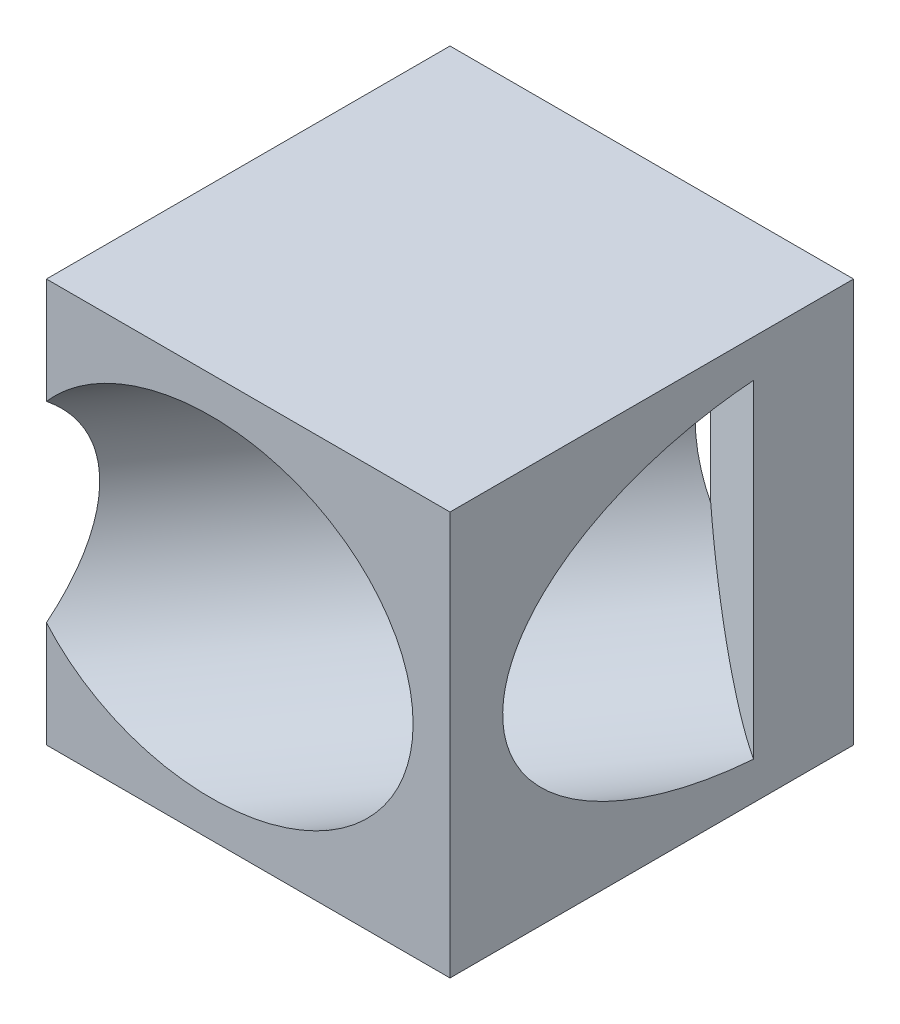
ISO-10303-21;
HEADER;
FILE_DESCRIPTION(('STEP AP214'),'2;1');
FILE_NAME('part.step','',(''),(''),'','','');
FILE_SCHEMA(('AUTOMOTIVE_DESIGN { 1 0 10303 214 1 1 1 1 }'));
ENDSEC;
DATA;
#1=APPLICATION_CONTEXT('core data for automotive mechanical design processes');
#2=APPLICATION_PROTOCOL_DEFINITION('international standard','automotive_design',2000,#1);
#3=PRODUCT_CONTEXT('',#1,'mechanical');
#4=PRODUCT('Part','Part','',(#3));
#5=PRODUCT_RELATED_PRODUCT_CATEGORY('part','',(#4));
#6=PRODUCT_DEFINITION_FORMATION('','',#4);
#7=PRODUCT_DEFINITION_CONTEXT('part definition',#1,'design');
#8=PRODUCT_DEFINITION('design','',#6,#7);
#9=PRODUCT_DEFINITION_SHAPE('','',#8);
#10=(LENGTH_UNIT() NAMED_UNIT(*) SI_UNIT(.MILLI.,.METRE.));
#11=(NAMED_UNIT(*) PLANE_ANGLE_UNIT() SI_UNIT($,.RADIAN.));
#12=(NAMED_UNIT(*) SI_UNIT($,.STERADIAN.) SOLID_ANGLE_UNIT());
#13=UNCERTAINTY_MEASURE_WITH_UNIT(LENGTH_MEASURE(1.E-05),#10,'distance_accuracy_value','');
#14=(GEOMETRIC_REPRESENTATION_CONTEXT(3) GLOBAL_UNCERTAINTY_ASSIGNED_CONTEXT((#13)) GLOBAL_UNIT_ASSIGNED_CONTEXT((#10,
#11,#12)) REPRESENTATION_CONTEXT('',''));
#15=CARTESIAN_POINT('',(0.,0.,0.));
#16=DIRECTION('',(0.,0.,1.));
#17=DIRECTION('',(1.,0.,0.));
#18=AXIS2_PLACEMENT_3D('',#15,#16,#17);
#19=CARTESIAN_POINT('',(70.5540395752603,0.,0.387942687063769));
#20=DIRECTION('',(-0.573576436351047,0.,0.819152044288991));
#21=DIRECTION('',(0.819152044288991,0.,0.573576436351047));
#22=AXIS2_PLACEMENT_3D('',#19,#20,#21);
#23=CYLINDRICAL_SURFACE('',#22,41.);
#24=CARTESIAN_POINT('',(0.804926148164548,0.,100.));
#25=DIRECTION('',(0.,0.,1.));
#26=DIRECTION('',(-1.,0.,0.));
#27=AXIS2_PLACEMENT_3D('',#24,#25,#26);
#28=ELLIPSE('',#27,50.0517581392197,41.);
#29=CARTESIAN_POINT('',(-40.,-23.7432106006988,100.));
#30=VERTEX_POINT('',#29);
#31=CARTESIAN_POINT('',(-40.,23.7432106006988,100.));
#32=VERTEX_POINT('',#31);
#33=EDGE_CURVE('E124',#30,#32,#28,.T.);
#34=ORIENTED_EDGE('',*,*,#33,.T.);
#35=CARTESIAN_POINT('',(-40.,0.,158.27547394376));
#36=DIRECTION('',(1.,0.,0.));
#37=DIRECTION('',(0.,0.,1.));
#38=AXIS2_PLACEMENT_3D('',#35,#36,#37);
#39=ELLIPSE('',#38,71.4813186204649,41.);
#40=EDGE_CURVE('E11',#32,#30,#39,.F.);
#41=ORIENTED_EDGE('',*,*,#40,.T.);
#42=EDGE_LOOP('',(#34,#41));
#43=FACE_BOUND('',#42,.T.);
#44=CARTESIAN_POINT('',(55.6205386339624,0.,21.7151922900598));
#45=DIRECTION('',(0.573576436351047,0.,-0.819152044288991));
#46=DIRECTION('',(-0.819152044288991,0.,-0.573576436351047));
#47=AXIS2_PLACEMENT_3D('',#44,#45,#46);
#48=CIRCLE('',#47,41.);
#49=CARTESIAN_POINT('',(60.,-40.6499286651768,24.7817241518576));
#50=VERTEX_POINT('',#49);
#51=CARTESIAN_POINT('',(24.6080300488918,-15.737685187684,0.));
#52=VERTEX_POINT('',#51);
#53=EDGE_CURVE('E103',#50,#52,#48,.T.);
#54=ORIENTED_EDGE('',*,*,#53,.T.);
#55=CARTESIAN_POINT('',(70.8256799691357,0.,0.));
#56=DIRECTION('',(0.,0.,1.));
#57=DIRECTION('',(-1.,0.,0.));
#58=AXIS2_PLACEMENT_3D('',#55,#56,#57);
#59=ELLIPSE('',#58,50.0517581392197,41.);
#60=CARTESIAN_POINT('',(24.6080300488918,15.7376851876839,0.));
#61=VERTEX_POINT('',#60);
#62=EDGE_CURVE('E96',#61,#52,#59,.T.);
#63=ORIENTED_EDGE('',*,*,#62,.F.);
#64=CARTESIAN_POINT('',(60.,40.6499286651768,24.7817241518576));
#65=VERTEX_POINT('',#64);
#66=EDGE_CURVE('E102',#61,#65,#48,.T.);
#67=ORIENTED_EDGE('',*,*,#66,.T.);
#68=CARTESIAN_POINT('',(60.,0.,15.4606732695492));
#69=DIRECTION('',(-1.,0.,0.));
#70=DIRECTION('',(0.,0.,1.));
#71=AXIS2_PLACEMENT_3D('',#68,#69,#70);
#72=ELLIPSE('',#71,71.4813186204649,41.);
#73=EDGE_CURVE('E44',#65,#50,#72,.F.);
#74=ORIENTED_EDGE('',*,*,#73,.T.);
#75=EDGE_LOOP('',(#54,#63,#67,#74));
#76=FACE_BOUND('',#75,.T.);
#77=ADVANCED_FACE('F36',(#43,#76),#23,.F.);
#78=CARTESIAN_POINT('',(-70.,50.,100.));
#79=DIRECTION('',(0.,-1.,0.));
#80=DIRECTION('',(0.,0.,-1.));
#81=AXIS2_PLACEMENT_3D('',#78,#79,#80);
#82=PLANE('',#81);
#83=DIRECTION('',(-1.,0.,0.));
#84=VECTOR('',#83,1.);
#85=CARTESIAN_POINT('',(-70.,50.,0.));
#86=LINE('',#85,#84);
#87=CARTESIAN_POINT('',(60.,50.,0.));
#88=VERTEX_POINT('',#87);
#89=CARTESIAN_POINT('',(-40.,50.,0.));
#90=VERTEX_POINT('',#89);
#91=EDGE_CURVE('E133',#88,#90,#86,.T.);
#92=ORIENTED_EDGE('',*,*,#91,.T.);
#93=DIRECTION('',(0.,0.,1.));
#94=VECTOR('',#93,1.);
#95=CARTESIAN_POINT('',(-40.,50.,0.));
#96=LINE('',#95,#94);
#97=CARTESIAN_POINT('',(-40.,50.,100.));
#98=VERTEX_POINT('',#97);
#99=EDGE_CURVE('E121',#90,#98,#96,.T.);
#100=ORIENTED_EDGE('',*,*,#99,.T.);
#101=DIRECTION('',(-1.,0.,0.));
#102=VECTOR('',#101,1.);
#103=CARTESIAN_POINT('',(-70.,50.,100.));
#104=LINE('',#103,#102);
#105=CARTESIAN_POINT('',(60.,50.,100.));
#106=VERTEX_POINT('',#105);
#107=EDGE_CURVE('E134',#106,#98,#104,.T.);
#108=ORIENTED_EDGE('',*,*,#107,.F.);
#109=DIRECTION('',(0.,0.,1.));
#110=VECTOR('',#109,1.);
#111=CARTESIAN_POINT('',(60.,50.,0.));
#112=LINE('',#111,#110);
#113=EDGE_CURVE('E126',#88,#106,#112,.T.);
#114=ORIENTED_EDGE('',*,*,#113,.F.);
#115=EDGE_LOOP('',(#92,#100,#108,#114));
#116=FACE_BOUND('',#115,.T.);
#117=ADVANCED_FACE('F38',(#116),#82,.F.);
#118=CARTESIAN_POINT('',(-70.,-50.,100.));
#119=DIRECTION('',(0.,1.,0.));
#120=DIRECTION('',(0.,0.,1.));
#121=AXIS2_PLACEMENT_3D('',#118,#119,#120);
#122=PLANE('',#121);
#123=DIRECTION('',(1.,0.,0.));
#124=VECTOR('',#123,1.);
#125=CARTESIAN_POINT('',(-70.,-50.,100.));
#126=LINE('',#125,#124);
#127=CARTESIAN_POINT('',(-40.,-50.,100.));
#128=VERTEX_POINT('',#127);
#129=CARTESIAN_POINT('',(60.,-50.,100.));
#130=VERTEX_POINT('',#129);
#131=EDGE_CURVE('E104',#128,#130,#126,.T.);
#132=ORIENTED_EDGE('',*,*,#131,.F.);
#133=DIRECTION('',(0.,0.,1.));
#134=VECTOR('',#133,1.);
#135=CARTESIAN_POINT('',(-40.,-50.,0.));
#136=LINE('',#135,#134);
#137=CARTESIAN_POINT('',(-40.,-50.,0.));
#138=VERTEX_POINT('',#137);
#139=EDGE_CURVE('E118',#138,#128,#136,.T.);
#140=ORIENTED_EDGE('',*,*,#139,.F.);
#141=DIRECTION('',(1.,0.,0.));
#142=VECTOR('',#141,1.);
#143=CARTESIAN_POINT('',(-70.,-50.,0.));
#144=LINE('',#143,#142);
#145=CARTESIAN_POINT('',(60.,-50.,0.));
#146=VERTEX_POINT('',#145);
#147=EDGE_CURVE('E137',#138,#146,#144,.T.);
#148=ORIENTED_EDGE('',*,*,#147,.T.);
#149=DIRECTION('',(0.,0.,1.));
#150=VECTOR('',#149,1.);
#151=CARTESIAN_POINT('',(60.,-50.,0.));
#152=LINE('',#151,#150);
#153=EDGE_CURVE('E128',#146,#130,#152,.T.);
#154=ORIENTED_EDGE('',*,*,#153,.T.);
#155=EDGE_LOOP('',(#132,#140,#148,#154));
#156=FACE_BOUND('',#155,.T.);
#157=ADVANCED_FACE('F163',(#156),#122,.F.);
#158=CARTESIAN_POINT('',(0.,0.,100.));
#159=DIRECTION('',(0.,0.,1.));
#160=DIRECTION('',(1.,0.,0.));
#161=AXIS2_PLACEMENT_3D('',#158,#159,#160);
#162=PLANE('',#161);
#163=DIRECTION('',(0.,1.,0.));
#164=VECTOR('',#163,1.);
#165=CARTESIAN_POINT('',(-40.,50.,100.));
#166=LINE('',#165,#164);
#167=EDGE_CURVE('E59',#128,#30,#166,.T.);
#168=ORIENTED_EDGE('',*,*,#167,.F.);
#169=ORIENTED_EDGE('',*,*,#131,.T.);
#170=DIRECTION('',(0.,-1.,0.));
#171=VECTOR('',#170,1.);
#172=CARTESIAN_POINT('',(60.,50.,100.));
#173=LINE('',#172,#171);
#174=EDGE_CURVE('E108',#106,#130,#173,.T.);
#175=ORIENTED_EDGE('',*,*,#174,.F.);
#176=ORIENTED_EDGE('',*,*,#107,.T.);
#177=EDGE_CURVE('E120',#32,#98,#166,.T.);
#178=ORIENTED_EDGE('',*,*,#177,.F.);
#179=ORIENTED_EDGE('',*,*,#33,.F.);
#180=EDGE_LOOP('',(#168,#169,#175,#176,#178,#179));
#181=FACE_BOUND('',#180,.T.);
#182=ADVANCED_FACE('F154',(#181),#162,.T.);
#183=CARTESIAN_POINT('',(0.,0.,0.));
#184=DIRECTION('',(0.,0.,1.));
#185=DIRECTION('',(1.,0.,0.));
#186=AXIS2_PLACEMENT_3D('',#183,#184,#185);
#187=PLANE('',#186);
#188=DIRECTION('',(0.,-1.,0.));
#189=VECTOR('',#188,1.);
#190=CARTESIAN_POINT('',(60.,50.,0.));
#191=LINE('',#190,#189);
#192=EDGE_CURVE('E111',#88,#146,#191,.T.);
#193=ORIENTED_EDGE('',*,*,#192,.T.);
#194=ORIENTED_EDGE('',*,*,#147,.F.);
#195=DIRECTION('',(0.,1.,0.));
#196=VECTOR('',#195,1.);
#197=CARTESIAN_POINT('',(-40.,50.,0.));
#198=LINE('',#197,#196);
#199=EDGE_CURVE('E115',#138,#90,#198,.T.);
#200=ORIENTED_EDGE('',*,*,#199,.T.);
#201=ORIENTED_EDGE('',*,*,#91,.F.);
#202=EDGE_LOOP('',(#193,#194,#200,#201));
#203=FACE_BOUND('',#202,.T.);
#204=ORIENTED_EDGE('',*,*,#62,.T.);
#205=DIRECTION('',(0.,-1.,0.));
#206=VECTOR('',#205,1.);
#207=CARTESIAN_POINT('',(24.6080300488918,0.,0.));
#208=LINE('',#207,#206);
#209=EDGE_CURVE('E51',#61,#52,#208,.T.);
#210=ORIENTED_EDGE('',*,*,#209,.F.);
#211=EDGE_LOOP('',(#204,#210));
#212=FACE_BOUND('',#211,.T.);
#213=ADVANCED_FACE('F95',(#203,#212),#187,.F.);
#214=CARTESIAN_POINT('',(60.,50.,0.));
#215=DIRECTION('',(-1.,0.,0.));
#216=DIRECTION('',(0.,-1.,0.));
#217=AXIS2_PLACEMENT_3D('',#214,#215,#216);
#218=PLANE('',#217);
#219=ORIENTED_EDGE('',*,*,#174,.T.);
#220=ORIENTED_EDGE('',*,*,#153,.F.);
#221=ORIENTED_EDGE('',*,*,#192,.F.);
#222=ORIENTED_EDGE('',*,*,#113,.T.);
#223=EDGE_LOOP('',(#219,#220,#221,#222));
#224=FACE_BOUND('',#223,.T.);
#225=ORIENTED_EDGE('',*,*,#73,.F.);
#226=DIRECTION('',(0.,1.,0.));
#227=VECTOR('',#226,1.);
#228=CARTESIAN_POINT('',(60.,0.,24.7817241518576));
#229=LINE('',#228,#227);
#230=EDGE_CURVE('E97',#50,#65,#229,.T.);
#231=ORIENTED_EDGE('',*,*,#230,.F.);
#232=EDGE_LOOP('',(#225,#231));
#233=FACE_BOUND('',#232,.T.);
#234=ADVANCED_FACE('F144',(#224,#233),#218,.F.);
#235=CARTESIAN_POINT('',(-40.,50.,0.));
#236=DIRECTION('',(1.,0.,0.));
#237=DIRECTION('',(0.,1.,0.));
#238=AXIS2_PLACEMENT_3D('',#235,#236,#237);
#239=PLANE('',#238);
#240=ORIENTED_EDGE('',*,*,#177,.T.);
#241=ORIENTED_EDGE('',*,*,#99,.F.);
#242=ORIENTED_EDGE('',*,*,#199,.F.);
#243=ORIENTED_EDGE('',*,*,#139,.T.);
#244=ORIENTED_EDGE('',*,*,#167,.T.);
#245=ORIENTED_EDGE('',*,*,#40,.F.);
#246=EDGE_LOOP('',(#240,#241,#242,#243,#244,#245));
#247=FACE_BOUND('',#246,.T.);
#248=ADVANCED_FACE('F146',(#247),#239,.F.);
#249=CARTESIAN_POINT('',(55.6205386339624,0.,21.7151922900598));
#250=DIRECTION('',(0.573576436351047,0.,-0.819152044288991));
#251=DIRECTION('',(-0.819152044288991,0.,-0.573576436351047));
#252=AXIS2_PLACEMENT_3D('',#249,#250,#251);
#253=PLANE('',#252);
#254=ORIENTED_EDGE('',*,*,#53,.F.);
#255=ORIENTED_EDGE('',*,*,#230,.T.);
#256=ORIENTED_EDGE('',*,*,#66,.F.);
#257=ORIENTED_EDGE('',*,*,#209,.T.);
#258=EDGE_LOOP('',(#254,#255,#256,#257));
#259=FACE_BOUND('',#258,.T.);
#260=ADVANCED_FACE('F106',(#259),#253,.F.);
#261=CLOSED_SHELL('',(#77,#117,#157,#182,#213,#234,#248,#260));
#262=MANIFOLD_SOLID_BREP('B2',#261);
#263=ADVANCED_BREP_SHAPE_REPRESENTATION('',(#18,#262),#14);
#264=SHAPE_DEFINITION_REPRESENTATION(#9,#263);
ENDSEC;
END-ISO-10303-21;
